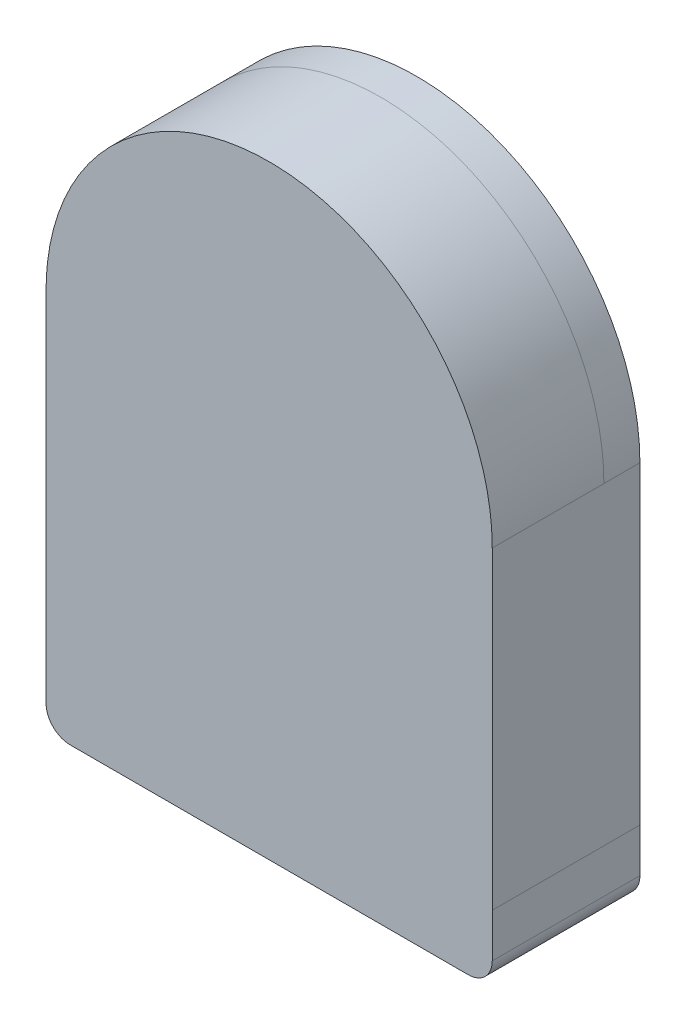
ISO-10303-21;
HEADER;
FILE_DESCRIPTION(('STEP AP214'),'2;1');
FILE_NAME('part.step','',(''),(''),'','','');
FILE_SCHEMA(('AUTOMOTIVE_DESIGN { 1 0 10303 214 1 1 1 1 }'));
ENDSEC;
DATA;
#1=APPLICATION_CONTEXT('core data for automotive mechanical design processes');
#2=APPLICATION_PROTOCOL_DEFINITION('international standard','automotive_design',2000,#1);
#3=PRODUCT_CONTEXT('',#1,'mechanical');
#4=PRODUCT('Part','Part','',(#3));
#5=PRODUCT_RELATED_PRODUCT_CATEGORY('part','',(#4));
#6=PRODUCT_DEFINITION_FORMATION('','',#4);
#7=PRODUCT_DEFINITION_CONTEXT('part definition',#1,'design');
#8=PRODUCT_DEFINITION('design','',#6,#7);
#9=PRODUCT_DEFINITION_SHAPE('','',#8);
#10=(LENGTH_UNIT() NAMED_UNIT(*) SI_UNIT(.MILLI.,.METRE.));
#11=(NAMED_UNIT(*) PLANE_ANGLE_UNIT() SI_UNIT($,.RADIAN.));
#12=(NAMED_UNIT(*) SI_UNIT($,.STERADIAN.) SOLID_ANGLE_UNIT());
#13=UNCERTAINTY_MEASURE_WITH_UNIT(LENGTH_MEASURE(1.E-05),#10,'distance_accuracy_value','');
#14=(GEOMETRIC_REPRESENTATION_CONTEXT(3) GLOBAL_UNCERTAINTY_ASSIGNED_CONTEXT((#13)) GLOBAL_UNIT_ASSIGNED_CONTEXT((#10,
#11,#12)) REPRESENTATION_CONTEXT('',''));
#15=CARTESIAN_POINT('',(0.,0.,0.));
#16=DIRECTION('',(0.,0.,1.));
#17=DIRECTION('',(1.,0.,0.));
#18=AXIS2_PLACEMENT_3D('',#15,#16,#17);
#19=CARTESIAN_POINT('',(8.29127246754,-14.8912724675,3.075));
#20=DIRECTION('',(0.,0.,-1.));
#21=DIRECTION('',(1.,0.,0.));
#22=AXIS2_PLACEMENT_3D('',#19,#20,#21);
#23=CYLINDRICAL_SURFACE('',#22,1.);
#24=CARTESIAN_POINT('',(8.29127246754,-14.8912724675,0.));
#25=DIRECTION('',(0.,0.,1.));
#26=DIRECTION('',(1.,0.,0.));
#27=AXIS2_PLACEMENT_3D('',#24,#25,#26);
#28=CIRCLE('',#27,1.);
#29=CARTESIAN_POINT('',(8.29127246754,-15.8912724675,0.));
#30=VERTEX_POINT('',#29);
#31=CARTESIAN_POINT('',(9.29127246754,-14.8912724675,0.));
#32=VERTEX_POINT('',#31);
#33=EDGE_CURVE('E11',#30,#32,#28,.T.);
#34=ORIENTED_EDGE('',*,*,#33,.T.);
#35=DIRECTION('',(0.,0.,-1.));
#36=VECTOR('',#35,1.);
#37=CARTESIAN_POINT('',(9.29127246754,-14.8912724675,3.075));
#38=LINE('',#37,#36);
#39=CARTESIAN_POINT('',(9.29127246754,-14.8912724675,6.15));
#40=VERTEX_POINT('',#39);
#41=EDGE_CURVE('E209',#40,#32,#38,.T.);
#42=ORIENTED_EDGE('',*,*,#41,.F.);
#43=CARTESIAN_POINT('',(8.29127246754,-14.8912724675,6.15));
#44=DIRECTION('',(0.,0.,-1.));
#45=DIRECTION('',(1.,0.,0.));
#46=AXIS2_PLACEMENT_3D('',#43,#44,#45);
#47=CIRCLE('',#46,1.);
#48=CARTESIAN_POINT('',(8.29127246754,-15.8912724675,6.15));
#49=VERTEX_POINT('',#48);
#50=EDGE_CURVE('E27',#40,#49,#47,.T.);
#51=ORIENTED_EDGE('',*,*,#50,.T.);
#52=DIRECTION('',(0.,0.,-1.));
#53=VECTOR('',#52,1.);
#54=CARTESIAN_POINT('',(8.29127246754,-15.8912724675,3.075));
#55=LINE('',#54,#53);
#56=EDGE_CURVE('E216',#49,#30,#55,.T.);
#57=ORIENTED_EDGE('',*,*,#56,.T.);
#58=EDGE_LOOP('',(#34,#42,#51,#57));
#59=FACE_BOUND('',#58,.T.);
#60=ADVANCED_FACE('F17',(#59),#23,.T.);
#61=CARTESIAN_POINT('',(0.,-3.3,0.));
#62=DIRECTION('',(0.,0.,1.));
#63=DIRECTION('',(1.,0.,0.));
#64=AXIS2_PLACEMENT_3D('',#61,#62,#63);
#65=PLANE('',#64);
#66=ORIENTED_EDGE('',*,*,#33,.F.);
#67=DIRECTION('',(1.,0.,0.));
#68=VECTOR('',#67,1.);
#69=CARTESIAN_POINT('',(6.67750706079,-15.8912724675,0.));
#70=LINE('',#69,#68);
#71=CARTESIAN_POINT('',(5.06374165404,-15.8912724675,0.));
#72=VERTEX_POINT('',#71);
#73=EDGE_CURVE('E205',#72,#30,#70,.T.);
#74=ORIENTED_EDGE('',*,*,#73,.F.);
#75=DIRECTION('',(1.,0.,0.));
#76=VECTOR('',#75,1.);
#77=CARTESIAN_POINT('',(0.00328049456473,-15.8912724675,0.));
#78=LINE('',#77,#76);
#79=CARTESIAN_POINT('',(-5.05718066429,-15.8912724675,0.));
#80=VERTEX_POINT('',#79);
#81=EDGE_CURVE('E162',#80,#72,#78,.T.);
#82=ORIENTED_EDGE('',*,*,#81,.F.);
#83=DIRECTION('',(1.,0.,0.));
#84=VECTOR('',#83,1.);
#85=CARTESIAN_POINT('',(-6.67422656592,-15.8912724675,0.));
#86=LINE('',#85,#84);
#87=CARTESIAN_POINT('',(-8.29127246754,-15.8912724675,0.));
#88=VERTEX_POINT('',#87);
#89=EDGE_CURVE('E157',#88,#80,#86,.T.);
#90=ORIENTED_EDGE('',*,*,#89,.F.);
#91=CARTESIAN_POINT('',(-8.29127246754,-14.8912724675,0.));
#92=DIRECTION('',(0.,0.,1.));
#93=DIRECTION('',(1.,0.,0.));
#94=AXIS2_PLACEMENT_3D('',#91,#92,#93);
#95=CIRCLE('',#94,1.);
#96=CARTESIAN_POINT('',(-9.29127246754,-14.8912724675,0.));
#97=VERTEX_POINT('',#96);
#98=EDGE_CURVE('E268',#97,#88,#95,.T.);
#99=ORIENTED_EDGE('',*,*,#98,.F.);
#100=DIRECTION('',(0.,-1.,0.));
#101=VECTOR('',#100,1.);
#102=CARTESIAN_POINT('',(-9.29127246754,-13.9425119181,0.));
#103=LINE('',#102,#101);
#104=CARTESIAN_POINT('',(-9.29127246754,-12.9937513688,0.));
#105=VERTEX_POINT('',#104);
#106=EDGE_CURVE('E75',#105,#97,#103,.T.);
#107=ORIENTED_EDGE('',*,*,#106,.F.);
#108=DIRECTION('',(0.,1.,0.));
#109=VECTOR('',#108,1.);
#110=CARTESIAN_POINT('',(-9.29127246754,-6.49687568471,0.));
#111=LINE('',#110,#109);
#112=CARTESIAN_POINT('',(-9.29127246754,0.,0.));
#113=VERTEX_POINT('',#112);
#114=EDGE_CURVE('E185',#105,#113,#111,.T.);
#115=ORIENTED_EDGE('',*,*,#114,.T.);
#116=CARTESIAN_POINT('',(0.,0.,0.));
#117=DIRECTION('',(0.,0.,1.));
#118=DIRECTION('',(1.,0.,0.));
#119=AXIS2_PLACEMENT_3D('',#116,#117,#118);
#120=CIRCLE('',#119,9.29127246754);
#121=CARTESIAN_POINT('',(9.29127246754,0.,0.));
#122=VERTEX_POINT('',#121);
#123=EDGE_CURVE('E180',#122,#113,#120,.T.);
#124=ORIENTED_EDGE('',*,*,#123,.F.);
#125=DIRECTION('',(0.,-1.,0.));
#126=VECTOR('',#125,1.);
#127=CARTESIAN_POINT('',(9.29127246754,-6.53289347638,0.));
#128=LINE('',#127,#126);
#129=CARTESIAN_POINT('',(9.29127246754,-13.0657869532,0.));
#130=VERTEX_POINT('',#129);
#131=EDGE_CURVE('E190',#122,#130,#128,.T.);
#132=ORIENTED_EDGE('',*,*,#131,.T.);
#133=DIRECTION('',(0.,1.,0.));
#134=VECTOR('',#133,1.);
#135=CARTESIAN_POINT('',(9.29127246754,-13.9785297104,0.));
#136=LINE('',#135,#134);
#137=EDGE_CURVE('E124',#32,#130,#136,.T.);
#138=ORIENTED_EDGE('',*,*,#137,.F.);
#139=EDGE_LOOP('',(#66,#74,#82,#90,#99,#107,#115,#124,#132,#138));
#140=FACE_BOUND('',#139,.T.);
#141=ADVANCED_FACE('F308',(#140),#65,.F.);
#142=CARTESIAN_POINT('',(0.,0.,6.15));
#143=DIRECTION('',(0.,0.,1.));
#144=DIRECTION('',(1.,0.,0.));
#145=AXIS2_PLACEMENT_3D('',#142,#143,#144);
#146=PLANE('',#145);
#147=DIRECTION('',(0.,1.,0.));
#148=VECTOR('',#147,1.);
#149=CARTESIAN_POINT('',(9.29127246754,-13.9785297104,6.15));
#150=LINE('',#149,#148);
#151=CARTESIAN_POINT('',(9.29127246754,-13.0657869532,6.15));
#152=VERTEX_POINT('',#151);
#153=EDGE_CURVE('E215',#40,#152,#150,.T.);
#154=ORIENTED_EDGE('',*,*,#153,.T.);
#155=DIRECTION('',(0.,1.,0.));
#156=VECTOR('',#155,1.);
#157=CARTESIAN_POINT('',(9.29127246754,-6.53289347666,6.15));
#158=LINE('',#157,#156);
#159=CARTESIAN_POINT('',(9.29127246754,-1.08640207941E-10,6.15));
#160=VERTEX_POINT('',#159);
#161=EDGE_CURVE('E194',#152,#160,#158,.T.);
#162=ORIENTED_EDGE('',*,*,#161,.T.);
#163=CARTESIAN_POINT('',(9.29127246754,-1.0863723428E-10,6.15));
#164=CARTESIAN_POINT('',(9.29127246754,1.45946966633,6.15));
#165=CARTESIAN_POINT('',(9.00470626867,2.91893933265,6.15));
#166=CARTESIAN_POINT('',(8.43129066116,4.30328706918,6.15));
#167=CARTESIAN_POINT('',(6.77255467012,6.77255467012,6.15));
#168=CARTESIAN_POINT('',(4.30328706918,8.43129066116,6.15));
#169=CARTESIAN_POINT('',(2.91893933265,9.00470626867,6.15));
#170=CARTESIAN_POINT('',(0.,9.5778386664,6.15));
#171=CARTESIAN_POINT('',(-2.91893933265,9.00470626867,6.15));
#172=CARTESIAN_POINT('',(-4.30328706918,8.43129066116,6.15));
#173=CARTESIAN_POINT('',(-6.77255467012,6.77255467012,6.15));
#174=CARTESIAN_POINT('',(-8.43129066116,4.30328706918,6.15));
#175=CARTESIAN_POINT('',(-9.00470626867,2.91893933265,6.15));
#176=CARTESIAN_POINT('',(-9.29127246754,1.45946966633,6.15));
#177=CARTESIAN_POINT('',(-9.29127246754,0.,6.15));
#178=(BOUNDED_CURVE() B_SPLINE_CURVE(5,(#163,#164,#165,#166,#167,#168,#169,#170,#171,#172,#173,
#174,#175,#176,#177),.UNSPECIFIED.,.F.,.F.) B_SPLINE_CURVE_WITH_KNOTS((6,3,3,3,6),
(-47.0355013243,-39.7381529927,-32.4408046611,-25.1434563295,-17.8461079978),
.UNSPECIFIED.) CURVE() GEOMETRIC_REPRESENTATION_ITEM() RATIONAL_B_SPLINE_CURVE((1.,1.,1.,1.,1.,
1.,1.,1.,1.,1.,1.,1.,1.,1.,1.)) REPRESENTATION_ITEM(''));
#179=CARTESIAN_POINT('',(-9.29127246754,0.,6.15));
#180=VERTEX_POINT('',#179);
#181=EDGE_CURVE('E184',#160,#180,#178,.T.);
#182=ORIENTED_EDGE('',*,*,#181,.T.);
#183=DIRECTION('',(0.,-1.,0.));
#184=VECTOR('',#183,1.);
#185=CARTESIAN_POINT('',(-9.29127246754,-6.49687568438,6.15));
#186=LINE('',#185,#184);
#187=CARTESIAN_POINT('',(-9.29127246754,-12.9937513688,6.15));
#188=VERTEX_POINT('',#187);
#189=EDGE_CURVE('E210',#180,#188,#186,.T.);
#190=ORIENTED_EDGE('',*,*,#189,.T.);
#191=DIRECTION('',(0.,-1.,0.));
#192=VECTOR('',#191,1.);
#193=CARTESIAN_POINT('',(-9.29127246754,-13.9425119181,6.15));
#194=LINE('',#193,#192);
#195=CARTESIAN_POINT('',(-9.29127246754,-14.8912724675,6.15));
#196=VERTEX_POINT('',#195);
#197=EDGE_CURVE('E60',#188,#196,#194,.T.);
#198=ORIENTED_EDGE('',*,*,#197,.T.);
#199=CARTESIAN_POINT('',(-8.29127246754,-14.8912724675,6.15));
#200=DIRECTION('',(0.,0.,-1.));
#201=DIRECTION('',(1.,0.,0.));
#202=AXIS2_PLACEMENT_3D('',#199,#200,#201);
#203=CIRCLE('',#202,1.);
#204=CARTESIAN_POINT('',(-8.29127246754,-15.8912724675,6.15));
#205=VERTEX_POINT('',#204);
#206=EDGE_CURVE('E206',#205,#196,#203,.T.);
#207=ORIENTED_EDGE('',*,*,#206,.F.);
#208=DIRECTION('',(1.,0.,0.));
#209=VECTOR('',#208,1.);
#210=CARTESIAN_POINT('',(-6.67422656592,-15.8912724675,6.15));
#211=LINE('',#210,#209);
#212=CARTESIAN_POINT('',(-5.05718066429,-15.8912724675,6.15));
#213=VERTEX_POINT('',#212);
#214=EDGE_CURVE('E199',#205,#213,#211,.T.);
#215=ORIENTED_EDGE('',*,*,#214,.T.);
#216=DIRECTION('',(1.,0.,0.));
#217=VECTOR('',#216,1.);
#218=CARTESIAN_POINT('',(0.00328049487454,-15.8912724675,6.15));
#219=LINE('',#218,#217);
#220=CARTESIAN_POINT('',(5.06374165404,-15.8912724675,6.15));
#221=VERTEX_POINT('',#220);
#222=EDGE_CURVE('E167',#213,#221,#219,.T.);
#223=ORIENTED_EDGE('',*,*,#222,.T.);
#224=DIRECTION('',(1.,0.,0.));
#225=VECTOR('',#224,1.);
#226=CARTESIAN_POINT('',(6.67750706079,-15.8912724675,6.15));
#227=LINE('',#226,#225);
#228=EDGE_CURVE('E135',#221,#49,#227,.T.);
#229=ORIENTED_EDGE('',*,*,#228,.T.);
#230=ORIENTED_EDGE('',*,*,#50,.F.);
#231=EDGE_LOOP('',(#154,#162,#182,#190,#198,#207,#215,#223,#229,#230));
#232=FACE_BOUND('',#231,.T.);
#233=ADVANCED_FACE('F316',(#232),#146,.T.);
#234=CARTESIAN_POINT('',(9.29127246754,-13.0657869525,0.));
#235=DIRECTION('',(1.,0.,0.));
#236=DIRECTION('',(0.,-1.,0.));
#237=AXIS2_PLACEMENT_3D('',#234,#235,#236);
#238=PLANE('',#237);
#239=ORIENTED_EDGE('',*,*,#137,.T.);
#240=DIRECTION('',(0.,0.,-1.));
#241=VECTOR('',#240,1.);
#242=CARTESIAN_POINT('',(9.29127246754,-13.0657869525,3.075));
#243=LINE('',#242,#241);
#244=EDGE_CURVE('E189',#152,#130,#243,.T.);
#245=ORIENTED_EDGE('',*,*,#244,.F.);
#246=ORIENTED_EDGE('',*,*,#153,.F.);
#247=ORIENTED_EDGE('',*,*,#41,.T.);
#248=EDGE_LOOP('',(#239,#245,#246,#247));
#249=FACE_BOUND('',#248,.T.);
#250=ADVANCED_FACE('F252',(#249),#238,.T.);
#251=CARTESIAN_POINT('',(-5.0571806643,-15.8912724675,0.));
#252=DIRECTION('',(0.,-1.,0.));
#253=DIRECTION('',(0.,0.,-1.));
#254=AXIS2_PLACEMENT_3D('',#251,#252,#253);
#255=PLANE('',#254);
#256=ORIENTED_EDGE('',*,*,#228,.F.);
#257=DIRECTION('',(0.,0.,-1.));
#258=VECTOR('',#257,1.);
#259=CARTESIAN_POINT('',(5.06374165404,-15.8912724675,3.825));
#260=LINE('',#259,#258);
#261=CARTESIAN_POINT('',(5.06374165404,-15.8912724675,1.5));
#262=VERTEX_POINT('',#261);
#263=EDGE_CURVE('E227',#221,#262,#260,.T.);
#264=ORIENTED_EDGE('',*,*,#263,.T.);
#265=DIRECTION('',(0.,0.,-1.));
#266=VECTOR('',#265,1.);
#267=CARTESIAN_POINT('',(5.06374165343,-15.8912724675,0.75));
#268=LINE('',#267,#266);
#269=EDGE_CURVE('E223',#262,#72,#268,.T.);
#270=ORIENTED_EDGE('',*,*,#269,.T.);
#271=ORIENTED_EDGE('',*,*,#73,.T.);
#272=ORIENTED_EDGE('',*,*,#56,.F.);
#273=EDGE_LOOP('',(#256,#264,#270,#271,#272));
#274=FACE_BOUND('',#273,.T.);
#275=ADVANCED_FACE('F344',(#274),#255,.T.);
#276=CARTESIAN_POINT('',(-8.29127246754,-14.8912724675,3.075));
#277=DIRECTION('',(0.,0.,-1.));
#278=DIRECTION('',(0.,-1.,0.));
#279=AXIS2_PLACEMENT_3D('',#276,#277,#278);
#280=CYLINDRICAL_SURFACE('',#279,1.);
#281=ORIENTED_EDGE('',*,*,#98,.T.);
#282=DIRECTION('',(0.,0.,-1.));
#283=VECTOR('',#282,1.);
#284=CARTESIAN_POINT('',(-8.29127246754,-15.8912724675,3.075));
#285=LINE('',#284,#283);
#286=EDGE_CURVE('E201',#205,#88,#285,.T.);
#287=ORIENTED_EDGE('',*,*,#286,.F.);
#288=ORIENTED_EDGE('',*,*,#206,.T.);
#289=DIRECTION('',(0.,0.,-1.));
#290=VECTOR('',#289,1.);
#291=CARTESIAN_POINT('',(-9.29127246754,-14.8912724675,3.075));
#292=LINE('',#291,#290);
#293=EDGE_CURVE('E195',#196,#97,#292,.T.);
#294=ORIENTED_EDGE('',*,*,#293,.T.);
#295=EDGE_LOOP('',(#281,#287,#288,#294));
#296=FACE_BOUND('',#295,.T.);
#297=ADVANCED_FACE('F352',(#296),#280,.T.);
#298=CARTESIAN_POINT('',(-5.0571806643,-15.8912724675,0.));
#299=DIRECTION('',(0.,-1.,0.));
#300=DIRECTION('',(0.,0.,-1.));
#301=AXIS2_PLACEMENT_3D('',#298,#299,#300);
#302=PLANE('',#301);
#303=ORIENTED_EDGE('',*,*,#89,.T.);
#304=DIRECTION('',(0.,0.,-1.));
#305=VECTOR('',#304,1.);
#306=CARTESIAN_POINT('',(-5.0571806643,-15.8912724675,0.75));
#307=LINE('',#306,#305);
#308=CARTESIAN_POINT('',(-5.0571806643,-15.8912724675,1.5));
#309=VERTEX_POINT('',#308);
#310=EDGE_CURVE('E150',#309,#80,#307,.T.);
#311=ORIENTED_EDGE('',*,*,#310,.F.);
#312=DIRECTION('',(0.,0.,-1.));
#313=VECTOR('',#312,1.);
#314=CARTESIAN_POINT('',(-5.05718066429,-15.8912724675,3.825));
#315=LINE('',#314,#313);
#316=EDGE_CURVE('E154',#213,#309,#315,.T.);
#317=ORIENTED_EDGE('',*,*,#316,.F.);
#318=ORIENTED_EDGE('',*,*,#214,.F.);
#319=ORIENTED_EDGE('',*,*,#286,.T.);
#320=EDGE_LOOP('',(#303,#311,#317,#318,#319));
#321=FACE_BOUND('',#320,.T.);
#322=ADVANCED_FACE('F152',(#321),#302,.T.);
#323=CARTESIAN_POINT('',(-9.29127246754,0.,0.));
#324=DIRECTION('',(-1.,0.,0.));
#325=DIRECTION('',(0.,1.,0.));
#326=AXIS2_PLACEMENT_3D('',#323,#324,#325);
#327=PLANE('',#326);
#328=ORIENTED_EDGE('',*,*,#197,.F.);
#329=DIRECTION('',(0.,0.,-1.));
#330=VECTOR('',#329,1.);
#331=CARTESIAN_POINT('',(-9.29127246754,-12.9937513688,3.075));
#332=LINE('',#331,#330);
#333=EDGE_CURVE('E188',#188,#105,#332,.T.);
#334=ORIENTED_EDGE('',*,*,#333,.T.);
#335=ORIENTED_EDGE('',*,*,#106,.T.);
#336=ORIENTED_EDGE('',*,*,#293,.F.);
#337=EDGE_LOOP('',(#328,#334,#335,#336));
#338=FACE_BOUND('',#337,.T.);
#339=ADVANCED_FACE('F301',(#338),#327,.T.);
#340=CARTESIAN_POINT('',(-9.29127246754,0.,0.));
#341=DIRECTION('',(-1.,0.,0.));
#342=DIRECTION('',(0.,1.,0.));
#343=AXIS2_PLACEMENT_3D('',#340,#341,#342);
#344=PLANE('',#343);
#345=ORIENTED_EDGE('',*,*,#114,.F.);
#346=ORIENTED_EDGE('',*,*,#333,.F.);
#347=ORIENTED_EDGE('',*,*,#189,.F.);
#348=DIRECTION('',(0.,0.,1.));
#349=VECTOR('',#348,1.);
#350=CARTESIAN_POINT('',(-9.29127246754,0.,3.825));
#351=LINE('',#350,#349);
#352=CARTESIAN_POINT('',(-9.29127246754,0.,1.5));
#353=VERTEX_POINT('',#352);
#354=EDGE_CURVE('E290',#353,#180,#351,.T.);
#355=ORIENTED_EDGE('',*,*,#354,.F.);
#356=DIRECTION('',(0.,0.,1.));
#357=VECTOR('',#356,1.);
#358=CARTESIAN_POINT('',(-9.29127246754,0.,0.));
#359=LINE('',#358,#357);
#360=EDGE_CURVE('E175',#113,#353,#359,.T.);
#361=ORIENTED_EDGE('',*,*,#360,.F.);
#362=EDGE_LOOP('',(#345,#346,#347,#355,#361));
#363=FACE_BOUND('',#362,.T.);
#364=ADVANCED_FACE('F305',(#363),#344,.T.);
#365=CARTESIAN_POINT('',(9.29127246754,-13.0657869525,0.));
#366=DIRECTION('',(1.,0.,0.));
#367=DIRECTION('',(0.,-1.,0.));
#368=AXIS2_PLACEMENT_3D('',#365,#366,#367);
#369=PLANE('',#368);
#370=ORIENTED_EDGE('',*,*,#131,.F.);
#371=DIRECTION('',(0.,0.,1.));
#372=VECTOR('',#371,1.);
#373=CARTESIAN_POINT('',(9.29127246754,0.,0.));
#374=LINE('',#373,#372);
#375=CARTESIAN_POINT('',(9.29127246754,-1.08640207941E-10,1.5));
#376=VERTEX_POINT('',#375);
#377=EDGE_CURVE('E169',#122,#376,#374,.T.);
#378=ORIENTED_EDGE('',*,*,#377,.T.);
#379=DIRECTION('',(0.,0.,1.));
#380=VECTOR('',#379,1.);
#381=CARTESIAN_POINT('',(9.29127246754,-1.08633546603E-10,3.825));
#382=LINE('',#381,#380);
#383=EDGE_CURVE('E314',#376,#160,#382,.T.);
#384=ORIENTED_EDGE('',*,*,#383,.T.);
#385=ORIENTED_EDGE('',*,*,#161,.F.);
#386=ORIENTED_EDGE('',*,*,#244,.T.);
#387=EDGE_LOOP('',(#370,#378,#384,#385,#386));
#388=FACE_BOUND('',#387,.T.);
#389=ADVANCED_FACE('F254',(#388),#369,.T.);
#390=CARTESIAN_POINT('',(-5.0571806643,-15.8912724675,0.));
#391=DIRECTION('',(0.,-1.,0.));
#392=DIRECTION('',(0.,0.,-1.));
#393=AXIS2_PLACEMENT_3D('',#390,#391,#392);
#394=PLANE('',#393);
#395=ORIENTED_EDGE('',*,*,#316,.T.);
#396=ORIENTED_EDGE('',*,*,#310,.T.);
#397=ORIENTED_EDGE('',*,*,#81,.T.);
#398=ORIENTED_EDGE('',*,*,#269,.F.);
#399=ORIENTED_EDGE('',*,*,#263,.F.);
#400=ORIENTED_EDGE('',*,*,#222,.F.);
#401=EDGE_LOOP('',(#395,#396,#397,#398,#399,#400));
#402=FACE_BOUND('',#401,.T.);
#403=ADVANCED_FACE('F165',(#402),#394,.T.);
#404=CARTESIAN_POINT('',(0.,0.,0.));
#405=DIRECTION('',(0.,0.,1.));
#406=DIRECTION('',(1.,0.,0.));
#407=AXIS2_PLACEMENT_3D('',#404,#405,#406);
#408=CYLINDRICAL_SURFACE('',#407,9.29127246754);
#409=ORIENTED_EDGE('',*,*,#123,.T.);
#410=ORIENTED_EDGE('',*,*,#360,.T.);
#411=CARTESIAN_POINT('',(9.29127246754,-1.0863723428E-10,1.5));
#412=CARTESIAN_POINT('',(9.29127246754,1.45946966633,1.5));
#413=CARTESIAN_POINT('',(9.00470626867,2.91893933265,1.5));
#414=CARTESIAN_POINT('',(8.43129066116,4.30328706918,1.5));
#415=CARTESIAN_POINT('',(6.77255467012,6.77255467012,1.5));
#416=CARTESIAN_POINT('',(4.30328706918,8.43129066116,1.5));
#417=CARTESIAN_POINT('',(2.91893933265,9.00470626867,1.5));
#418=CARTESIAN_POINT('',(0.,9.5778386664,1.5));
#419=CARTESIAN_POINT('',(-2.91893933265,9.00470626867,1.5));
#420=CARTESIAN_POINT('',(-4.30328706918,8.43129066116,1.5));
#421=CARTESIAN_POINT('',(-6.77255467012,6.77255467012,1.5));
#422=CARTESIAN_POINT('',(-8.43129066116,4.30328706918,1.5));
#423=CARTESIAN_POINT('',(-9.00470626867,2.91893933265,1.5));
#424=CARTESIAN_POINT('',(-9.29127246754,1.45946966633,1.5));
#425=CARTESIAN_POINT('',(-9.29127246754,0.,1.5));
#426=(BOUNDED_CURVE() B_SPLINE_CURVE(5,(#411,#412,#413,#414,#415,#416,#417,#418,#419,#420,#421,
#422,#423,#424,#425),.UNSPECIFIED.,.F.,.F.) B_SPLINE_CURVE_WITH_KNOTS((6,3,3,3,6),(0.,
7.433822163,14.8676443261,22.30146648915,29.7352886522),
.UNSPECIFIED.) CURVE() GEOMETRIC_REPRESENTATION_ITEM() RATIONAL_B_SPLINE_CURVE((1.,1.,1.,1.,1.,
1.,1.,1.,1.,1.,1.,1.,1.,1.,1.)) REPRESENTATION_ITEM(''));
#427=EDGE_CURVE('E234',#376,#353,#426,.T.);
#428=ORIENTED_EDGE('',*,*,#427,.F.);
#429=ORIENTED_EDGE('',*,*,#377,.F.);
#430=EDGE_LOOP('',(#409,#410,#428,#429));
#431=FACE_BOUND('',#430,.T.);
#432=ADVANCED_FACE('F251',(#431),#408,.T.);
#433=CARTESIAN_POINT('',(-9.29127246754,0.,1.5));
#434=CARTESIAN_POINT('',(-9.29127246754,1.45946966633,1.5));
#435=CARTESIAN_POINT('',(-9.00470626867,2.91893933265,1.5));
#436=CARTESIAN_POINT('',(-8.43129066116,4.30328706918,1.5));
#437=CARTESIAN_POINT('',(-6.77255467012,6.77255467012,1.5));
#438=CARTESIAN_POINT('',(-4.30328706918,8.43129066116,1.5));
#439=CARTESIAN_POINT('',(-2.91893933265,9.00470626867,1.5));
#440=CARTESIAN_POINT('',(0.,9.5778386664,1.5));
#441=CARTESIAN_POINT('',(2.91893933265,9.00470626867,1.5));
#442=CARTESIAN_POINT('',(4.30328706918,8.43129066116,1.5));
#443=CARTESIAN_POINT('',(6.77255467012,6.77255467012,1.5));
#444=CARTESIAN_POINT('',(8.43129066116,4.30328706918,1.5));
#445=CARTESIAN_POINT('',(9.00470626867,2.91893933265,1.5));
#446=CARTESIAN_POINT('',(9.29127246754,1.45946966633,1.5));
#447=CARTESIAN_POINT('',(9.29127246754,-1.0863723428E-10,1.5));
#448=(BOUNDED_CURVE() B_SPLINE_CURVE(5,(#433,#434,#435,#436,#437,#438,#439,#440,#441,#442,#443,
#444,#445,#446,#447),.UNSPECIFIED.,.F.,.F.) B_SPLINE_CURVE_WITH_KNOTS((6,3,3,3,6),(0.,
7.43382216305,14.8676443261,22.3014664892,29.7352886522),
.UNSPECIFIED.) CURVE() GEOMETRIC_REPRESENTATION_ITEM() RATIONAL_B_SPLINE_CURVE((1.,1.,1.,1.,1.,
1.,1.,1.,1.,1.,1.,1.,1.,1.,1.)) REPRESENTATION_ITEM(''));
#449=DIRECTION('',(0.,0.,1.));
#450=VECTOR('',#449,1.);
#451=SURFACE_OF_LINEAR_EXTRUSION('',#448,#450);
#452=ORIENTED_EDGE('',*,*,#383,.F.);
#453=ORIENTED_EDGE('',*,*,#427,.T.);
#454=ORIENTED_EDGE('',*,*,#354,.T.);
#455=ORIENTED_EDGE('',*,*,#181,.F.);
#456=EDGE_LOOP('',(#452,#453,#454,#455));
#457=FACE_BOUND('',#456,.T.);
#458=ADVANCED_FACE('F240',(#457),#451,.F.);
#459=CLOSED_SHELL('',(#60,#141,#233,#250,#275,#297,#322,#339,#364,#389,#403,#432,#458));
#460=MANIFOLD_SOLID_BREP('B1',#459);
#461=ADVANCED_BREP_SHAPE_REPRESENTATION('',(#18,#460),#14);
#462=SHAPE_DEFINITION_REPRESENTATION(#9,#461);
ENDSEC;
END-ISO-10303-21;
